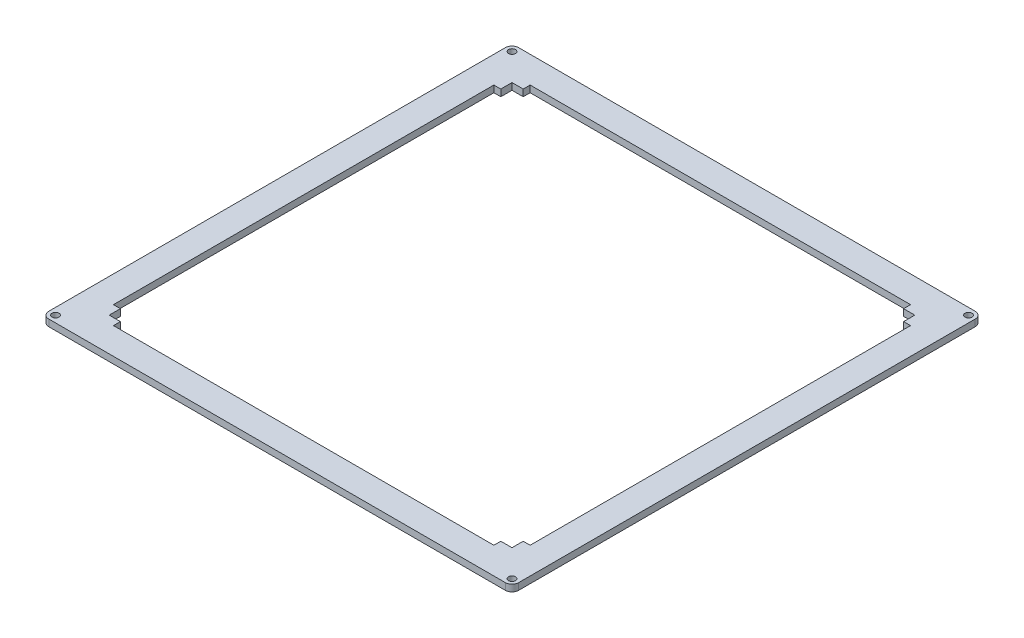
ISO-10303-21;
HEADER;
FILE_DESCRIPTION(('STEP AP214'),'2;1');
FILE_NAME('part.step','',(''),(''),'','','');
FILE_SCHEMA(('AUTOMOTIVE_DESIGN { 1 0 10303 214 1 1 1 1 }'));
ENDSEC;
DATA;
#1=APPLICATION_CONTEXT('core data for automotive mechanical design processes');
#2=APPLICATION_PROTOCOL_DEFINITION('international standard','automotive_design',2000,#1);
#3=PRODUCT_CONTEXT('',#1,'mechanical');
#4=PRODUCT('Part','Part','',(#3));
#5=PRODUCT_RELATED_PRODUCT_CATEGORY('part','',(#4));
#6=PRODUCT_DEFINITION_FORMATION('','',#4);
#7=PRODUCT_DEFINITION_CONTEXT('part definition',#1,'design');
#8=PRODUCT_DEFINITION('design','',#6,#7);
#9=PRODUCT_DEFINITION_SHAPE('','',#8);
#10=(LENGTH_UNIT() NAMED_UNIT(*) SI_UNIT(.MILLI.,.METRE.));
#11=(NAMED_UNIT(*) PLANE_ANGLE_UNIT() SI_UNIT($,.RADIAN.));
#12=(NAMED_UNIT(*) SI_UNIT($,.STERADIAN.) SOLID_ANGLE_UNIT());
#13=UNCERTAINTY_MEASURE_WITH_UNIT(LENGTH_MEASURE(1.E-05),#10,'distance_accuracy_value','');
#14=(GEOMETRIC_REPRESENTATION_CONTEXT(3) GLOBAL_UNCERTAINTY_ASSIGNED_CONTEXT((#13)) GLOBAL_UNIT_ASSIGNED_CONTEXT((#10,
#11,#12)) REPRESENTATION_CONTEXT('',''));
#15=CARTESIAN_POINT('',(0.,0.,0.));
#16=DIRECTION('',(0.,0.,1.));
#17=DIRECTION('',(1.,0.,0.));
#18=AXIS2_PLACEMENT_3D('',#15,#16,#17);
#19=CARTESIAN_POINT('',(20.0000000000018,3.,-1.79068229778268E-13));
#20=DIRECTION('',(1.,0.,0.));
#21=DIRECTION('',(0.,0.,-1.));
#22=AXIS2_PLACEMENT_3D('',#19,#20,#21);
#23=PLANE('',#22);
#24=DIRECTION('',(0.,0.,1.));
#25=VECTOR('',#24,1.);
#26=CARTESIAN_POINT('',(20.0000000000018,0.,-1.79068229778268E-13));
#27=LINE('',#26,#25);
#28=CARTESIAN_POINT('',(20.,0.,-198.1));
#29=VERTEX_POINT('',#28);
#30=CARTESIAN_POINT('',(20.0000000000001,0.,-195.));
#31=VERTEX_POINT('',#30);
#32=EDGE_CURVE('E404',#29,#31,#27,.T.);
#33=ORIENTED_EDGE('',*,*,#32,.F.);
#34=DIRECTION('',(0.,-1.,0.));
#35=VECTOR('',#34,1.);
#36=CARTESIAN_POINT('',(20.,3.,-198.1));
#37=LINE('',#36,#35);
#38=CARTESIAN_POINT('',(20.,3.,-198.1));
#39=VERTEX_POINT('',#38);
#40=EDGE_CURVE('E11',#39,#29,#37,.T.);
#41=ORIENTED_EDGE('',*,*,#40,.F.);
#42=DIRECTION('',(0.,0.,1.));
#43=VECTOR('',#42,1.);
#44=CARTESIAN_POINT('',(20.0000000000018,3.,-1.79068229778268E-13));
#45=LINE('',#44,#43);
#46=CARTESIAN_POINT('',(20.0000000000001,3.,-195.));
#47=VERTEX_POINT('',#46);
#48=EDGE_CURVE('E325',#39,#47,#45,.T.);
#49=ORIENTED_EDGE('',*,*,#48,.T.);
#50=DIRECTION('',(0.,-1.,0.));
#51=VECTOR('',#50,1.);
#52=CARTESIAN_POINT('',(20.0000000000001,3.,-195.));
#53=LINE('',#52,#51);
#54=EDGE_CURVE('E61',#47,#31,#53,.T.);
#55=ORIENTED_EDGE('',*,*,#54,.T.);
#56=EDGE_LOOP('',(#33,#41,#49,#55));
#57=FACE_BOUND('',#56,.T.);
#58=ADVANCED_FACE('F41',(#57),#23,.T.);
#59=CARTESIAN_POINT('',(0.,3.,-198.1));
#60=DIRECTION('',(0.,0.,1.));
#61=DIRECTION('',(1.,0.,0.));
#62=AXIS2_PLACEMENT_3D('',#59,#60,#61);
#63=PLANE('',#62);
#64=DIRECTION('',(-1.,0.,0.));
#65=VECTOR('',#64,1.);
#66=CARTESIAN_POINT('',(0.,0.,-198.1));
#67=LINE('',#66,#65);
#68=CARTESIAN_POINT('',(190.,0.,-198.1));
#69=VERTEX_POINT('',#68);
#70=EDGE_CURVE('E399',#69,#29,#67,.T.);
#71=ORIENTED_EDGE('',*,*,#70,.F.);
#72=DIRECTION('',(0.,-1.,0.));
#73=VECTOR('',#72,1.);
#74=CARTESIAN_POINT('',(190.,3.,-198.1));
#75=LINE('',#74,#73);
#76=CARTESIAN_POINT('',(190.,3.,-198.1));
#77=VERTEX_POINT('',#76);
#78=EDGE_CURVE('E52',#77,#69,#75,.T.);
#79=ORIENTED_EDGE('',*,*,#78,.F.);
#80=DIRECTION('',(-1.,0.,0.));
#81=VECTOR('',#80,1.);
#82=CARTESIAN_POINT('',(0.,3.,-198.1));
#83=LINE('',#82,#81);
#84=EDGE_CURVE('E319',#77,#39,#83,.T.);
#85=ORIENTED_EDGE('',*,*,#84,.T.);
#86=ORIENTED_EDGE('',*,*,#40,.T.);
#87=EDGE_LOOP('',(#71,#79,#85,#86));
#88=FACE_BOUND('',#87,.T.);
#89=ADVANCED_FACE('F575',(#88),#63,.T.);
#90=CARTESIAN_POINT('',(190.,3.,0.));
#91=DIRECTION('',(1.,0.,0.));
#92=DIRECTION('',(0.,0.,-1.));
#93=AXIS2_PLACEMENT_3D('',#90,#91,#92);
#94=PLANE('',#93);
#95=DIRECTION('',(0.,0.,1.));
#96=VECTOR('',#95,1.);
#97=CARTESIAN_POINT('',(190.,0.,0.));
#98=LINE('',#97,#96);
#99=CARTESIAN_POINT('',(190.,0.,-195.));
#100=VERTEX_POINT('',#99);
#101=EDGE_CURVE('E389',#69,#100,#98,.T.);
#102=ORIENTED_EDGE('',*,*,#101,.T.);
#103=DIRECTION('',(0.,-1.,0.));
#104=VECTOR('',#103,1.);
#105=CARTESIAN_POINT('',(190.,3.,-195.));
#106=LINE('',#105,#104);
#107=CARTESIAN_POINT('',(190.,3.,-195.));
#108=VERTEX_POINT('',#107);
#109=EDGE_CURVE('E557',#108,#100,#106,.T.);
#110=ORIENTED_EDGE('',*,*,#109,.F.);
#111=DIRECTION('',(0.,0.,1.));
#112=VECTOR('',#111,1.);
#113=CARTESIAN_POINT('',(190.,3.,0.));
#114=LINE('',#113,#112);
#115=EDGE_CURVE('E316',#77,#108,#114,.T.);
#116=ORIENTED_EDGE('',*,*,#115,.F.);
#117=ORIENTED_EDGE('',*,*,#78,.T.);
#118=EDGE_LOOP('',(#102,#110,#116,#117));
#119=FACE_BOUND('',#118,.T.);
#120=ADVANCED_FACE('F580',(#119),#94,.F.);
#121=CARTESIAN_POINT('',(0.,3.,-195.));
#122=DIRECTION('',(0.,0.,1.));
#123=DIRECTION('',(1.,0.,0.));
#124=AXIS2_PLACEMENT_3D('',#121,#122,#123);
#125=PLANE('',#124);
#126=DIRECTION('',(-1.,0.,0.));
#127=VECTOR('',#126,1.);
#128=CARTESIAN_POINT('',(0.,0.,-195.));
#129=LINE('',#128,#127);
#130=CARTESIAN_POINT('',(195.,0.,-195.));
#131=VERTEX_POINT('',#130);
#132=EDGE_CURVE('E379',#131,#100,#129,.T.);
#133=ORIENTED_EDGE('',*,*,#132,.F.);
#134=DIRECTION('',(0.,-1.,0.));
#135=VECTOR('',#134,1.);
#136=CARTESIAN_POINT('',(195.,3.,-195.));
#137=LINE('',#136,#135);
#138=CARTESIAN_POINT('',(195.,3.,-195.));
#139=VERTEX_POINT('',#138);
#140=EDGE_CURVE('E554',#139,#131,#137,.T.);
#141=ORIENTED_EDGE('',*,*,#140,.F.);
#142=DIRECTION('',(-1.,0.,0.));
#143=VECTOR('',#142,1.);
#144=CARTESIAN_POINT('',(0.,3.,-195.));
#145=LINE('',#144,#143);
#146=EDGE_CURVE('E265',#139,#108,#145,.T.);
#147=ORIENTED_EDGE('',*,*,#146,.T.);
#148=ORIENTED_EDGE('',*,*,#109,.T.);
#149=EDGE_LOOP('',(#133,#141,#147,#148));
#150=FACE_BOUND('',#149,.T.);
#151=ADVANCED_FACE('F660',(#150),#125,.T.);
#152=CARTESIAN_POINT('',(195.,3.,0.));
#153=DIRECTION('',(1.,0.,0.));
#154=DIRECTION('',(0.,0.,-1.));
#155=AXIS2_PLACEMENT_3D('',#152,#153,#154);
#156=PLANE('',#155);
#157=DIRECTION('',(0.,0.,1.));
#158=VECTOR('',#157,1.);
#159=CARTESIAN_POINT('',(195.,0.,0.));
#160=LINE('',#159,#158);
#161=CARTESIAN_POINT('',(195.,0.,-190.));
#162=VERTEX_POINT('',#161);
#163=EDGE_CURVE('E388',#131,#162,#160,.T.);
#164=ORIENTED_EDGE('',*,*,#163,.T.);
#165=DIRECTION('',(0.,-1.,0.));
#166=VECTOR('',#165,1.);
#167=CARTESIAN_POINT('',(195.,3.,-190.));
#168=LINE('',#167,#166);
#169=CARTESIAN_POINT('',(195.,3.,-190.));
#170=VERTEX_POINT('',#169);
#171=EDGE_CURVE('E550',#170,#162,#168,.T.);
#172=ORIENTED_EDGE('',*,*,#171,.F.);
#173=DIRECTION('',(0.,0.,1.));
#174=VECTOR('',#173,1.);
#175=CARTESIAN_POINT('',(195.,3.,0.));
#176=LINE('',#175,#174);
#177=EDGE_CURVE('E298',#139,#170,#176,.T.);
#178=ORIENTED_EDGE('',*,*,#177,.F.);
#179=ORIENTED_EDGE('',*,*,#140,.T.);
#180=EDGE_LOOP('',(#164,#172,#178,#179));
#181=FACE_BOUND('',#180,.T.);
#182=ADVANCED_FACE('F843',(#181),#156,.F.);
#183=CARTESIAN_POINT('',(0.,3.,-190.));
#184=DIRECTION('',(0.,0.,-1.));
#185=DIRECTION('',(-1.,0.,0.));
#186=AXIS2_PLACEMENT_3D('',#183,#184,#185);
#187=PLANE('',#186);
#188=DIRECTION('',(1.,0.,0.));
#189=VECTOR('',#188,1.);
#190=CARTESIAN_POINT('',(0.,0.,-190.));
#191=LINE('',#190,#189);
#192=CARTESIAN_POINT('',(198.1,0.,-190.));
#193=VERTEX_POINT('',#192);
#194=EDGE_CURVE('E396',#162,#193,#191,.T.);
#195=ORIENTED_EDGE('',*,*,#194,.T.);
#196=DIRECTION('',(0.,-1.,0.));
#197=VECTOR('',#196,1.);
#198=CARTESIAN_POINT('',(198.1,3.,-190.));
#199=LINE('',#198,#197);
#200=CARTESIAN_POINT('',(198.1,3.,-190.));
#201=VERTEX_POINT('',#200);
#202=EDGE_CURVE('E546',#201,#193,#199,.T.);
#203=ORIENTED_EDGE('',*,*,#202,.F.);
#204=DIRECTION('',(1.,0.,0.));
#205=VECTOR('',#204,1.);
#206=CARTESIAN_POINT('',(0.,3.,-190.));
#207=LINE('',#206,#205);
#208=EDGE_CURVE('E308',#170,#201,#207,.T.);
#209=ORIENTED_EDGE('',*,*,#208,.F.);
#210=ORIENTED_EDGE('',*,*,#171,.T.);
#211=EDGE_LOOP('',(#195,#203,#209,#210));
#212=FACE_BOUND('',#211,.T.);
#213=ADVANCED_FACE('F864',(#212),#187,.F.);
#214=CARTESIAN_POINT('',(198.1,3.,0.));
#215=DIRECTION('',(1.,0.,0.));
#216=DIRECTION('',(0.,0.,-1.));
#217=AXIS2_PLACEMENT_3D('',#214,#215,#216);
#218=PLANE('',#217);
#219=DIRECTION('',(0.,0.,1.));
#220=VECTOR('',#219,1.);
#221=CARTESIAN_POINT('',(198.1,0.,0.));
#222=LINE('',#221,#220);
#223=CARTESIAN_POINT('',(198.1,0.,-20.0000000000001));
#224=VERTEX_POINT('',#223);
#225=EDGE_CURVE('E939',#193,#224,#222,.T.);
#226=ORIENTED_EDGE('',*,*,#225,.T.);
#227=DIRECTION('',(0.,-1.,0.));
#228=VECTOR('',#227,1.);
#229=CARTESIAN_POINT('',(198.1,3.,-20.0000000000001));
#230=LINE('',#229,#228);
#231=CARTESIAN_POINT('',(198.1,3.,-20.0000000000001));
#232=VERTEX_POINT('',#231);
#233=EDGE_CURVE('E543',#232,#224,#230,.T.);
#234=ORIENTED_EDGE('',*,*,#233,.F.);
#235=DIRECTION('',(0.,0.,1.));
#236=VECTOR('',#235,1.);
#237=CARTESIAN_POINT('',(198.1,3.,0.));
#238=LINE('',#237,#236);
#239=EDGE_CURVE('E304',#201,#232,#238,.T.);
#240=ORIENTED_EDGE('',*,*,#239,.F.);
#241=ORIENTED_EDGE('',*,*,#202,.T.);
#242=EDGE_LOOP('',(#226,#234,#240,#241));
#243=FACE_BOUND('',#242,.T.);
#244=ADVANCED_FACE('F853',(#243),#218,.F.);
#245=CARTESIAN_POINT('',(0.,3.,-20.0000000000001));
#246=DIRECTION('',(0.,0.,-1.));
#247=DIRECTION('',(-1.,0.,0.));
#248=AXIS2_PLACEMENT_3D('',#245,#246,#247);
#249=PLANE('',#248);
#250=DIRECTION('',(1.,0.,0.));
#251=VECTOR('',#250,1.);
#252=CARTESIAN_POINT('',(0.,0.,-20.0000000000001));
#253=LINE('',#252,#251);
#254=CARTESIAN_POINT('',(195.,0.,-20.0000000000001));
#255=VERTEX_POINT('',#254);
#256=EDGE_CURVE('E942',#255,#224,#253,.T.);
#257=ORIENTED_EDGE('',*,*,#256,.F.);
#258=DIRECTION('',(0.,-1.,0.));
#259=VECTOR('',#258,1.);
#260=CARTESIAN_POINT('',(195.,3.,-20.0000000000001));
#261=LINE('',#260,#259);
#262=CARTESIAN_POINT('',(195.,3.,-20.0000000000001));
#263=VERTEX_POINT('',#262);
#264=EDGE_CURVE('E540',#263,#255,#261,.T.);
#265=ORIENTED_EDGE('',*,*,#264,.F.);
#266=DIRECTION('',(1.,0.,0.));
#267=VECTOR('',#266,1.);
#268=CARTESIAN_POINT('',(0.,3.,-20.0000000000001));
#269=LINE('',#268,#267);
#270=EDGE_CURVE('E296',#263,#232,#269,.T.);
#271=ORIENTED_EDGE('',*,*,#270,.T.);
#272=ORIENTED_EDGE('',*,*,#233,.T.);
#273=EDGE_LOOP('',(#257,#265,#271,#272));
#274=FACE_BOUND('',#273,.T.);
#275=ADVANCED_FACE('F840',(#274),#249,.T.);
#276=CARTESIAN_POINT('',(195.,0.,-15.));
#277=VERTEX_POINT('',#276);
#278=EDGE_CURVE('E397',#255,#277,#160,.T.);
#279=ORIENTED_EDGE('',*,*,#278,.T.);
#280=DIRECTION('',(0.,-1.,0.));
#281=VECTOR('',#280,1.);
#282=CARTESIAN_POINT('',(195.,3.,-15.));
#283=LINE('',#282,#281);
#284=CARTESIAN_POINT('',(195.,3.,-15.));
#285=VERTEX_POINT('',#284);
#286=EDGE_CURVE('E536',#285,#277,#283,.T.);
#287=ORIENTED_EDGE('',*,*,#286,.F.);
#288=EDGE_CURVE('E290',#263,#285,#176,.T.);
#289=ORIENTED_EDGE('',*,*,#288,.F.);
#290=ORIENTED_EDGE('',*,*,#264,.T.);
#291=EDGE_LOOP('',(#279,#287,#289,#290));
#292=FACE_BOUND('',#291,.T.);
#293=ADVANCED_FACE('F830',(#292),#156,.F.);
#294=CARTESIAN_POINT('',(0.,3.,-15.));
#295=DIRECTION('',(0.,0.,1.));
#296=DIRECTION('',(1.,0.,0.));
#297=AXIS2_PLACEMENT_3D('',#294,#295,#296);
#298=PLANE('',#297);
#299=DIRECTION('',(-1.,0.,0.));
#300=VECTOR('',#299,1.);
#301=CARTESIAN_POINT('',(0.,0.,-15.));
#302=LINE('',#301,#300);
#303=CARTESIAN_POINT('',(190.,0.,-15.));
#304=VERTEX_POINT('',#303);
#305=EDGE_CURVE('E946',#277,#304,#302,.T.);
#306=ORIENTED_EDGE('',*,*,#305,.T.);
#307=DIRECTION('',(0.,-1.,0.));
#308=VECTOR('',#307,1.);
#309=CARTESIAN_POINT('',(190.,3.,-15.));
#310=LINE('',#309,#308);
#311=CARTESIAN_POINT('',(190.,3.,-15.));
#312=VERTEX_POINT('',#311);
#313=EDGE_CURVE('E532',#312,#304,#310,.T.);
#314=ORIENTED_EDGE('',*,*,#313,.F.);
#315=DIRECTION('',(-1.,0.,0.));
#316=VECTOR('',#315,1.);
#317=CARTESIAN_POINT('',(0.,3.,-15.));
#318=LINE('',#317,#316);
#319=EDGE_CURVE('E278',#285,#312,#318,.T.);
#320=ORIENTED_EDGE('',*,*,#319,.F.);
#321=ORIENTED_EDGE('',*,*,#286,.T.);
#322=EDGE_LOOP('',(#306,#314,#320,#321));
#323=FACE_BOUND('',#322,.T.);
#324=ADVANCED_FACE('F788',(#323),#298,.F.);
#325=CARTESIAN_POINT('',(190.,3.,0.));
#326=DIRECTION('',(1.,0.,0.));
#327=DIRECTION('',(0.,0.,-1.));
#328=AXIS2_PLACEMENT_3D('',#325,#326,#327);
#329=PLANE('',#328);
#330=DIRECTION('',(0.,0.,1.));
#331=VECTOR('',#330,1.);
#332=CARTESIAN_POINT('',(190.,0.,0.));
#333=LINE('',#332,#331);
#334=CARTESIAN_POINT('',(190.,0.,-11.9));
#335=VERTEX_POINT('',#334);
#336=EDGE_CURVE('E949',#304,#335,#333,.T.);
#337=ORIENTED_EDGE('',*,*,#336,.T.);
#338=DIRECTION('',(0.,-1.,0.));
#339=VECTOR('',#338,1.);
#340=CARTESIAN_POINT('',(190.,3.,-11.9));
#341=LINE('',#340,#339);
#342=CARTESIAN_POINT('',(190.,3.,-11.9));
#343=VERTEX_POINT('',#342);
#344=EDGE_CURVE('E528',#343,#335,#341,.T.);
#345=ORIENTED_EDGE('',*,*,#344,.F.);
#346=DIRECTION('',(0.,0.,1.));
#347=VECTOR('',#346,1.);
#348=CARTESIAN_POINT('',(190.,3.,0.));
#349=LINE('',#348,#347);
#350=EDGE_CURVE('E289',#312,#343,#349,.T.);
#351=ORIENTED_EDGE('',*,*,#350,.F.);
#352=ORIENTED_EDGE('',*,*,#313,.T.);
#353=EDGE_LOOP('',(#337,#345,#351,#352));
#354=FACE_BOUND('',#353,.T.);
#355=ADVANCED_FACE('F809',(#354),#329,.F.);
#356=CARTESIAN_POINT('',(0.,3.,-11.9));
#357=DIRECTION('',(0.,0.,1.));
#358=DIRECTION('',(1.,0.,0.));
#359=AXIS2_PLACEMENT_3D('',#356,#357,#358);
#360=PLANE('',#359);
#361=DIRECTION('',(-1.,0.,0.));
#362=VECTOR('',#361,1.);
#363=CARTESIAN_POINT('',(0.,0.,-11.9));
#364=LINE('',#363,#362);
#365=CARTESIAN_POINT('',(20.,0.,-11.9));
#366=VERTEX_POINT('',#365);
#367=EDGE_CURVE('E954',#335,#366,#364,.T.);
#368=ORIENTED_EDGE('',*,*,#367,.T.);
#369=DIRECTION('',(0.,-1.,0.));
#370=VECTOR('',#369,1.);
#371=CARTESIAN_POINT('',(20.,3.,-11.9));
#372=LINE('',#371,#370);
#373=CARTESIAN_POINT('',(20.,3.,-11.9));
#374=VERTEX_POINT('',#373);
#375=EDGE_CURVE('E525',#374,#366,#372,.T.);
#376=ORIENTED_EDGE('',*,*,#375,.F.);
#377=DIRECTION('',(-1.,0.,0.));
#378=VECTOR('',#377,1.);
#379=CARTESIAN_POINT('',(0.,3.,-11.9));
#380=LINE('',#379,#378);
#381=EDGE_CURVE('E284',#343,#374,#380,.T.);
#382=ORIENTED_EDGE('',*,*,#381,.F.);
#383=ORIENTED_EDGE('',*,*,#344,.T.);
#384=EDGE_LOOP('',(#368,#376,#382,#383));
#385=FACE_BOUND('',#384,.T.);
#386=ADVANCED_FACE('F798',(#385),#360,.F.);
#387=CARTESIAN_POINT('',(20.,3.,0.));
#388=DIRECTION('',(1.,0.,0.));
#389=DIRECTION('',(0.,0.,-1.));
#390=AXIS2_PLACEMENT_3D('',#387,#388,#389);
#391=PLANE('',#390);
#392=DIRECTION('',(0.,0.,1.));
#393=VECTOR('',#392,1.);
#394=CARTESIAN_POINT('',(20.,0.,0.));
#395=LINE('',#394,#393);
#396=CARTESIAN_POINT('',(20.,0.,-15.));
#397=VERTEX_POINT('',#396);
#398=EDGE_CURVE('E957',#397,#366,#395,.T.);
#399=ORIENTED_EDGE('',*,*,#398,.F.);
#400=DIRECTION('',(0.,-1.,0.));
#401=VECTOR('',#400,1.);
#402=CARTESIAN_POINT('',(20.,3.,-15.));
#403=LINE('',#402,#401);
#404=CARTESIAN_POINT('',(20.,3.,-15.));
#405=VERTEX_POINT('',#404);
#406=EDGE_CURVE('E522',#405,#397,#403,.T.);
#407=ORIENTED_EDGE('',*,*,#406,.F.);
#408=DIRECTION('',(0.,0.,1.));
#409=VECTOR('',#408,1.);
#410=CARTESIAN_POINT('',(20.,3.,0.));
#411=LINE('',#410,#409);
#412=EDGE_CURVE('E276',#405,#374,#411,.T.);
#413=ORIENTED_EDGE('',*,*,#412,.T.);
#414=ORIENTED_EDGE('',*,*,#375,.T.);
#415=EDGE_LOOP('',(#399,#407,#413,#414));
#416=FACE_BOUND('',#415,.T.);
#417=ADVANCED_FACE('F785',(#416),#391,.T.);
#418=CARTESIAN_POINT('',(15.,0.,-15.));
#419=VERTEX_POINT('',#418);
#420=EDGE_CURVE('E960',#397,#419,#302,.T.);
#421=ORIENTED_EDGE('',*,*,#420,.T.);
#422=DIRECTION('',(0.,-1.,0.));
#423=VECTOR('',#422,1.);
#424=CARTESIAN_POINT('',(15.,3.,-15.));
#425=LINE('',#424,#423);
#426=CARTESIAN_POINT('',(15.,3.,-15.));
#427=VERTEX_POINT('',#426);
#428=EDGE_CURVE('E519',#427,#419,#425,.T.);
#429=ORIENTED_EDGE('',*,*,#428,.F.);
#430=EDGE_CURVE('E271',#405,#427,#318,.T.);
#431=ORIENTED_EDGE('',*,*,#430,.F.);
#432=ORIENTED_EDGE('',*,*,#406,.T.);
#433=EDGE_LOOP('',(#421,#429,#431,#432));
#434=FACE_BOUND('',#433,.T.);
#435=ADVANCED_FACE('F776',(#434),#298,.F.);
#436=CARTESIAN_POINT('',(15.,3.,0.));
#437=DIRECTION('',(1.,0.,0.));
#438=DIRECTION('',(0.,0.,-1.));
#439=AXIS2_PLACEMENT_3D('',#436,#437,#438);
#440=PLANE('',#439);
#441=DIRECTION('',(0.,0.,1.));
#442=VECTOR('',#441,1.);
#443=CARTESIAN_POINT('',(15.,0.,0.));
#444=LINE('',#443,#442);
#445=CARTESIAN_POINT('',(15.,0.,-20.));
#446=VERTEX_POINT('',#445);
#447=EDGE_CURVE('E383',#446,#419,#444,.T.);
#448=ORIENTED_EDGE('',*,*,#447,.F.);
#449=DIRECTION('',(0.,-1.,0.));
#450=VECTOR('',#449,1.);
#451=CARTESIAN_POINT('',(15.,3.,-20.));
#452=LINE('',#451,#450);
#453=CARTESIAN_POINT('',(15.,3.,-20.));
#454=VERTEX_POINT('',#453);
#455=EDGE_CURVE('E516',#454,#446,#452,.T.);
#456=ORIENTED_EDGE('',*,*,#455,.F.);
#457=DIRECTION('',(0.,0.,1.));
#458=VECTOR('',#457,1.);
#459=CARTESIAN_POINT('',(15.,3.,0.));
#460=LINE('',#459,#458);
#461=EDGE_CURVE('E261',#454,#427,#460,.T.);
#462=ORIENTED_EDGE('',*,*,#461,.T.);
#463=ORIENTED_EDGE('',*,*,#428,.T.);
#464=EDGE_LOOP('',(#448,#456,#462,#463));
#465=FACE_BOUND('',#464,.T.);
#466=ADVANCED_FACE('F573',(#465),#440,.T.);
#467=CARTESIAN_POINT('',(0.,3.,-20.));
#468=DIRECTION('',(0.,0.,1.));
#469=DIRECTION('',(1.,0.,0.));
#470=AXIS2_PLACEMENT_3D('',#467,#468,#469);
#471=PLANE('',#470);
#472=DIRECTION('',(-1.,0.,0.));
#473=VECTOR('',#472,1.);
#474=CARTESIAN_POINT('',(0.,0.,-20.));
#475=LINE('',#474,#473);
#476=CARTESIAN_POINT('',(11.9,0.,-20.));
#477=VERTEX_POINT('',#476);
#478=EDGE_CURVE('E966',#446,#477,#475,.T.);
#479=ORIENTED_EDGE('',*,*,#478,.T.);
#480=DIRECTION('',(0.,-1.,0.));
#481=VECTOR('',#480,1.);
#482=CARTESIAN_POINT('',(11.9,3.,-20.));
#483=LINE('',#482,#481);
#484=CARTESIAN_POINT('',(11.9,3.,-20.));
#485=VERTEX_POINT('',#484);
#486=EDGE_CURVE('E512',#485,#477,#483,.T.);
#487=ORIENTED_EDGE('',*,*,#486,.F.);
#488=DIRECTION('',(-1.,0.,0.));
#489=VECTOR('',#488,1.);
#490=CARTESIAN_POINT('',(0.,3.,-20.));
#491=LINE('',#490,#489);
#492=EDGE_CURVE('E270',#454,#485,#491,.T.);
#493=ORIENTED_EDGE('',*,*,#492,.F.);
#494=ORIENTED_EDGE('',*,*,#455,.T.);
#495=EDGE_LOOP('',(#479,#487,#493,#494));
#496=FACE_BOUND('',#495,.T.);
#497=ADVANCED_FACE('F755',(#496),#471,.F.);
#498=CARTESIAN_POINT('',(11.9,3.,0.));
#499=DIRECTION('',(-1.,0.,0.));
#500=DIRECTION('',(0.,0.,1.));
#501=AXIS2_PLACEMENT_3D('',#498,#499,#500);
#502=PLANE('',#501);
#503=DIRECTION('',(0.,0.,-1.));
#504=VECTOR('',#503,1.);
#505=CARTESIAN_POINT('',(11.9,0.,0.));
#506=LINE('',#505,#504);
#507=CARTESIAN_POINT('',(11.9,0.,-190.));
#508=VERTEX_POINT('',#507);
#509=EDGE_CURVE('E970',#477,#508,#506,.T.);
#510=ORIENTED_EDGE('',*,*,#509,.T.);
#511=DIRECTION('',(0.,-1.,0.));
#512=VECTOR('',#511,1.);
#513=CARTESIAN_POINT('',(11.9,3.,-190.));
#514=LINE('',#513,#512);
#515=CARTESIAN_POINT('',(11.9,3.,-190.));
#516=VERTEX_POINT('',#515);
#517=EDGE_CURVE('E244',#516,#508,#514,.T.);
#518=ORIENTED_EDGE('',*,*,#517,.F.);
#519=DIRECTION('',(0.,0.,-1.));
#520=VECTOR('',#519,1.);
#521=CARTESIAN_POINT('',(11.9,3.,0.));
#522=LINE('',#521,#520);
#523=EDGE_CURVE('E253',#485,#516,#522,.T.);
#524=ORIENTED_EDGE('',*,*,#523,.F.);
#525=ORIENTED_EDGE('',*,*,#486,.T.);
#526=EDGE_LOOP('',(#510,#518,#524,#525));
#527=FACE_BOUND('',#526,.T.);
#528=ADVANCED_FACE('F745',(#527),#502,.F.);
#529=CARTESIAN_POINT('',(0.,3.,-190.));
#530=DIRECTION('',(0.,0.,1.));
#531=DIRECTION('',(1.,0.,0.));
#532=AXIS2_PLACEMENT_3D('',#529,#530,#531);
#533=PLANE('',#532);
#534=DIRECTION('',(-1.,0.,0.));
#535=VECTOR('',#534,1.);
#536=CARTESIAN_POINT('',(0.,0.,-190.));
#537=LINE('',#536,#535);
#538=CARTESIAN_POINT('',(15.,0.,-190.));
#539=VERTEX_POINT('',#538);
#540=EDGE_CURVE('E239',#539,#508,#537,.T.);
#541=ORIENTED_EDGE('',*,*,#540,.F.);
#542=DIRECTION('',(0.,-1.,0.));
#543=VECTOR('',#542,1.);
#544=CARTESIAN_POINT('',(15.,3.,-190.));
#545=LINE('',#544,#543);
#546=CARTESIAN_POINT('',(15.,3.,-190.));
#547=VERTEX_POINT('',#546);
#548=EDGE_CURVE('E234',#547,#539,#545,.T.);
#549=ORIENTED_EDGE('',*,*,#548,.F.);
#550=DIRECTION('',(-1.,0.,0.));
#551=VECTOR('',#550,1.);
#552=CARTESIAN_POINT('',(0.,3.,-190.));
#553=LINE('',#552,#551);
#554=EDGE_CURVE('E237',#547,#516,#553,.T.);
#555=ORIENTED_EDGE('',*,*,#554,.T.);
#556=ORIENTED_EDGE('',*,*,#517,.T.);
#557=EDGE_LOOP('',(#541,#549,#555,#556));
#558=FACE_BOUND('',#557,.T.);
#559=ADVANCED_FACE('F236',(#558),#533,.T.);
#560=CARTESIAN_POINT('',(15.,0.,-195.));
#561=VERTEX_POINT('',#560);
#562=EDGE_CURVE('E377',#561,#539,#444,.T.);
#563=ORIENTED_EDGE('',*,*,#562,.F.);
#564=DIRECTION('',(0.,-1.,0.));
#565=VECTOR('',#564,1.);
#566=CARTESIAN_POINT('',(15.,3.,-195.));
#567=LINE('',#566,#565);
#568=CARTESIAN_POINT('',(15.,3.,-195.));
#569=VERTEX_POINT('',#568);
#570=EDGE_CURVE('E146',#569,#561,#567,.T.);
#571=ORIENTED_EDGE('',*,*,#570,.F.);
#572=EDGE_CURVE('E251',#569,#547,#460,.T.);
#573=ORIENTED_EDGE('',*,*,#572,.T.);
#574=ORIENTED_EDGE('',*,*,#548,.T.);
#575=EDGE_LOOP('',(#563,#571,#573,#574));
#576=FACE_BOUND('',#575,.T.);
#577=ADVANCED_FACE('F257',(#576),#440,.T.);
#578=CARTESIAN_POINT('',(3.,3.,-3.));
#579=DIRECTION('',(0.,-1.,0.));
#580=DIRECTION('',(0.,0.,-1.));
#581=AXIS2_PLACEMENT_3D('',#578,#579,#580);
#582=CYLINDRICAL_SURFACE('',#581,3.);
#583=CARTESIAN_POINT('',(3.,0.,-3.));
#584=DIRECTION('',(0.,1.,0.));
#585=DIRECTION('',(0.,0.,1.));
#586=AXIS2_PLACEMENT_3D('',#583,#584,#585);
#587=CIRCLE('',#586,3.);
#588=CARTESIAN_POINT('',(3.,0.,0.));
#589=VERTEX_POINT('',#588);
#590=CARTESIAN_POINT('',(0.,0.,-3.));
#591=VERTEX_POINT('',#590);
#592=EDGE_CURVE('E453',#589,#591,#587,.F.);
#593=ORIENTED_EDGE('',*,*,#592,.F.);
#594=DIRECTION('',(0.,-1.,0.));
#595=VECTOR('',#594,1.);
#596=CARTESIAN_POINT('',(3.,3.,0.));
#597=LINE('',#596,#595);
#598=CARTESIAN_POINT('',(3.,3.,0.));
#599=VERTEX_POINT('',#598);
#600=EDGE_CURVE('E45',#599,#589,#597,.T.);
#601=ORIENTED_EDGE('',*,*,#600,.F.);
#602=CARTESIAN_POINT('',(3.,3.,-3.));
#603=DIRECTION('',(0.,1.,0.));
#604=DIRECTION('',(0.,0.,1.));
#605=AXIS2_PLACEMENT_3D('',#602,#603,#604);
#606=CIRCLE('',#605,3.);
#607=CARTESIAN_POINT('',(0.,3.,-3.));
#608=VERTEX_POINT('',#607);
#609=EDGE_CURVE('E370',#599,#608,#606,.F.);
#610=ORIENTED_EDGE('',*,*,#609,.T.);
#611=DIRECTION('',(0.,-1.,0.));
#612=VECTOR('',#611,1.);
#613=CARTESIAN_POINT('',(0.,3.,-3.));
#614=LINE('',#613,#612);
#615=EDGE_CURVE('E263',#608,#591,#614,.T.);
#616=ORIENTED_EDGE('',*,*,#615,.T.);
#617=EDGE_LOOP('',(#593,#601,#610,#616));
#618=FACE_BOUND('',#617,.T.);
#619=ADVANCED_FACE('F43',(#618),#582,.T.);
#620=CARTESIAN_POINT('',(0.,3.,0.));
#621=DIRECTION('',(0.,0.,-1.));
#622=DIRECTION('',(-1.,0.,0.));
#623=AXIS2_PLACEMENT_3D('',#620,#621,#622);
#624=PLANE('',#623);
#625=DIRECTION('',(1.,0.,0.));
#626=VECTOR('',#625,1.);
#627=CARTESIAN_POINT('',(0.,0.,0.));
#628=LINE('',#627,#626);
#629=CARTESIAN_POINT('',(207.,0.,0.));
#630=VERTEX_POINT('',#629);
#631=EDGE_CURVE('E449',#589,#630,#628,.T.);
#632=ORIENTED_EDGE('',*,*,#631,.T.);
#633=DIRECTION('',(0.,-1.,0.));
#634=VECTOR('',#633,1.);
#635=CARTESIAN_POINT('',(207.,3.,0.));
#636=LINE('',#635,#634);
#637=CARTESIAN_POINT('',(207.,3.,0.));
#638=VERTEX_POINT('',#637);
#639=EDGE_CURVE('E497',#638,#630,#636,.T.);
#640=ORIENTED_EDGE('',*,*,#639,.F.);
#641=DIRECTION('',(1.,0.,0.));
#642=VECTOR('',#641,1.);
#643=CARTESIAN_POINT('',(0.,3.,0.));
#644=LINE('',#643,#642);
#645=EDGE_CURVE('E367',#599,#638,#644,.T.);
#646=ORIENTED_EDGE('',*,*,#645,.F.);
#647=ORIENTED_EDGE('',*,*,#600,.T.);
#648=EDGE_LOOP('',(#632,#640,#646,#647));
#649=FACE_BOUND('',#648,.T.);
#650=ADVANCED_FACE('F501',(#649),#624,.F.);
#651=CARTESIAN_POINT('',(207.,3.,-3.));
#652=DIRECTION('',(0.,-1.,0.));
#653=DIRECTION('',(0.,0.,-1.));
#654=AXIS2_PLACEMENT_3D('',#651,#652,#653);
#655=CYLINDRICAL_SURFACE('',#654,3.);
#656=CARTESIAN_POINT('',(207.,0.,-3.));
#657=DIRECTION('',(0.,1.,0.));
#658=DIRECTION('',(0.,0.,1.));
#659=AXIS2_PLACEMENT_3D('',#656,#657,#658);
#660=CIRCLE('',#659,3.);
#661=CARTESIAN_POINT('',(210.,0.,-3.));
#662=VERTEX_POINT('',#661);
#663=EDGE_CURVE('E445',#662,#630,#660,.F.);
#664=ORIENTED_EDGE('',*,*,#663,.F.);
#665=DIRECTION('',(0.,-1.,0.));
#666=VECTOR('',#665,1.);
#667=CARTESIAN_POINT('',(210.,3.,-3.));
#668=LINE('',#667,#666);
#669=CARTESIAN_POINT('',(210.,3.,-3.));
#670=VERTEX_POINT('',#669);
#671=EDGE_CURVE('E490',#670,#662,#668,.T.);
#672=ORIENTED_EDGE('',*,*,#671,.F.);
#673=CARTESIAN_POINT('',(207.,3.,-3.));
#674=DIRECTION('',(0.,1.,0.));
#675=DIRECTION('',(0.,0.,1.));
#676=AXIS2_PLACEMENT_3D('',#673,#674,#675);
#677=CIRCLE('',#676,3.);
#678=EDGE_CURVE('E363',#670,#638,#677,.F.);
#679=ORIENTED_EDGE('',*,*,#678,.T.);
#680=ORIENTED_EDGE('',*,*,#639,.T.);
#681=EDGE_LOOP('',(#664,#672,#679,#680));
#682=FACE_BOUND('',#681,.T.);
#683=ADVANCED_FACE('F495',(#682),#655,.T.);
#684=CARTESIAN_POINT('',(210.,3.,0.));
#685=DIRECTION('',(-1.,0.,0.));
#686=DIRECTION('',(0.,0.,1.));
#687=AXIS2_PLACEMENT_3D('',#684,#685,#686);
#688=PLANE('',#687);
#689=DIRECTION('',(0.,0.,-1.));
#690=VECTOR('',#689,1.);
#691=CARTESIAN_POINT('',(210.,0.,0.));
#692=LINE('',#691,#690);
#693=CARTESIAN_POINT('',(210.,0.,-207.));
#694=VERTEX_POINT('',#693);
#695=EDGE_CURVE('E441',#662,#694,#692,.T.);
#696=ORIENTED_EDGE('',*,*,#695,.T.);
#697=DIRECTION('',(0.,-1.,0.));
#698=VECTOR('',#697,1.);
#699=CARTESIAN_POINT('',(210.,3.,-207.));
#700=LINE('',#699,#698);
#701=CARTESIAN_POINT('',(210.,3.,-207.));
#702=VERTEX_POINT('',#701);
#703=EDGE_CURVE('E483',#702,#694,#700,.T.);
#704=ORIENTED_EDGE('',*,*,#703,.F.);
#705=DIRECTION('',(0.,0.,-1.));
#706=VECTOR('',#705,1.);
#707=CARTESIAN_POINT('',(210.,3.,0.));
#708=LINE('',#707,#706);
#709=EDGE_CURVE('E360',#670,#702,#708,.T.);
#710=ORIENTED_EDGE('',*,*,#709,.F.);
#711=ORIENTED_EDGE('',*,*,#671,.T.);
#712=EDGE_LOOP('',(#696,#704,#710,#711));
#713=FACE_BOUND('',#712,.T.);
#714=ADVANCED_FACE('F492',(#713),#688,.F.);
#715=CARTESIAN_POINT('',(207.,3.,-207.));
#716=DIRECTION('',(0.,-1.,0.));
#717=DIRECTION('',(0.,0.,-1.));
#718=AXIS2_PLACEMENT_3D('',#715,#716,#717);
#719=CYLINDRICAL_SURFACE('',#718,3.);
#720=CARTESIAN_POINT('',(207.,0.,-207.));
#721=DIRECTION('',(0.,1.,0.));
#722=DIRECTION('',(0.,0.,1.));
#723=AXIS2_PLACEMENT_3D('',#720,#721,#722);
#724=CIRCLE('',#723,3.);
#725=CARTESIAN_POINT('',(207.,0.,-210.));
#726=VERTEX_POINT('',#725);
#727=EDGE_CURVE('E437',#726,#694,#724,.F.);
#728=ORIENTED_EDGE('',*,*,#727,.F.);
#729=DIRECTION('',(0.,-1.,0.));
#730=VECTOR('',#729,1.);
#731=CARTESIAN_POINT('',(207.,3.,-210.));
#732=LINE('',#731,#730);
#733=CARTESIAN_POINT('',(207.,3.,-210.));
#734=VERTEX_POINT('',#733);
#735=EDGE_CURVE('E479',#734,#726,#732,.T.);
#736=ORIENTED_EDGE('',*,*,#735,.F.);
#737=CARTESIAN_POINT('',(207.,3.,-207.));
#738=DIRECTION('',(0.,1.,0.));
#739=DIRECTION('',(0.,0.,1.));
#740=AXIS2_PLACEMENT_3D('',#737,#738,#739);
#741=CIRCLE('',#740,3.);
#742=EDGE_CURVE('E356',#734,#702,#741,.F.);
#743=ORIENTED_EDGE('',*,*,#742,.T.);
#744=ORIENTED_EDGE('',*,*,#703,.T.);
#745=EDGE_LOOP('',(#728,#736,#743,#744));
#746=FACE_BOUND('',#745,.T.);
#747=ADVANCED_FACE('F485',(#746),#719,.T.);
#748=CARTESIAN_POINT('',(0.,3.,-210.));
#749=DIRECTION('',(0.,0.,-1.));
#750=DIRECTION('',(-1.,0.,0.));
#751=AXIS2_PLACEMENT_3D('',#748,#749,#750);
#752=PLANE('',#751);
#753=DIRECTION('',(1.,0.,0.));
#754=VECTOR('',#753,1.);
#755=CARTESIAN_POINT('',(0.,0.,-210.));
#756=LINE('',#755,#754);
#757=CARTESIAN_POINT('',(3.,0.,-210.));
#758=VERTEX_POINT('',#757);
#759=EDGE_CURVE('E433',#758,#726,#756,.T.);
#760=ORIENTED_EDGE('',*,*,#759,.F.);
#761=DIRECTION('',(0.,-1.,0.));
#762=VECTOR('',#761,1.);
#763=CARTESIAN_POINT('',(3.,3.,-210.));
#764=LINE('',#763,#762);
#765=CARTESIAN_POINT('',(3.,3.,-210.));
#766=VERTEX_POINT('',#765);
#767=EDGE_CURVE('E470',#766,#758,#764,.T.);
#768=ORIENTED_EDGE('',*,*,#767,.F.);
#769=DIRECTION('',(1.,0.,0.));
#770=VECTOR('',#769,1.);
#771=CARTESIAN_POINT('',(0.,3.,-210.));
#772=LINE('',#771,#770);
#773=EDGE_CURVE('E352',#766,#734,#772,.T.);
#774=ORIENTED_EDGE('',*,*,#773,.T.);
#775=ORIENTED_EDGE('',*,*,#735,.T.);
#776=EDGE_LOOP('',(#760,#768,#774,#775));
#777=FACE_BOUND('',#776,.T.);
#778=ADVANCED_FACE('F477',(#777),#752,.T.);
#779=CARTESIAN_POINT('',(3.,3.,-207.));
#780=DIRECTION('',(0.,-1.,0.));
#781=DIRECTION('',(0.,0.,-1.));
#782=AXIS2_PLACEMENT_3D('',#779,#780,#781);
#783=CYLINDRICAL_SURFACE('',#782,3.);
#784=CARTESIAN_POINT('',(3.,0.,-207.));
#785=DIRECTION('',(0.,1.,0.));
#786=DIRECTION('',(0.,0.,1.));
#787=AXIS2_PLACEMENT_3D('',#784,#785,#786);
#788=CIRCLE('',#787,3.);
#789=CARTESIAN_POINT('',(0.,0.,-207.));
#790=VERTEX_POINT('',#789);
#791=EDGE_CURVE('E429',#790,#758,#788,.F.);
#792=ORIENTED_EDGE('',*,*,#791,.F.);
#793=DIRECTION('',(0.,-1.,0.));
#794=VECTOR('',#793,1.);
#795=CARTESIAN_POINT('',(0.,3.,-207.));
#796=LINE('',#795,#794);
#797=CARTESIAN_POINT('',(0.,3.,-207.));
#798=VERTEX_POINT('',#797);
#799=EDGE_CURVE('E465',#798,#790,#796,.T.);
#800=ORIENTED_EDGE('',*,*,#799,.F.);
#801=CARTESIAN_POINT('',(3.,3.,-207.));
#802=DIRECTION('',(0.,1.,0.));
#803=DIRECTION('',(0.,0.,1.));
#804=AXIS2_PLACEMENT_3D('',#801,#802,#803);
#805=CIRCLE('',#804,3.);
#806=EDGE_CURVE('E348',#798,#766,#805,.F.);
#807=ORIENTED_EDGE('',*,*,#806,.T.);
#808=ORIENTED_EDGE('',*,*,#767,.T.);
#809=EDGE_LOOP('',(#792,#800,#807,#808));
#810=FACE_BOUND('',#809,.T.);
#811=ADVANCED_FACE('F472',(#810),#783,.T.);
#812=CARTESIAN_POINT('',(3.,3.,-3.));
#813=DIRECTION('',(0.,-1.,0.));
#814=DIRECTION('',(0.,0.,-1.));
#815=AXIS2_PLACEMENT_3D('',#812,#813,#814);
#816=CYLINDRICAL_SURFACE('',#815,1.55);
#817=CARTESIAN_POINT('',(3.,3.,-3.));
#818=DIRECTION('',(0.,1.,0.));
#819=DIRECTION('',(0.,0.,1.));
#820=AXIS2_PLACEMENT_3D('',#817,#818,#819);
#821=CIRCLE('',#820,1.55);
#822=CARTESIAN_POINT('',(3.,3.,-1.45));
#823=VERTEX_POINT('',#822);
#824=EDGE_CURVE('E328',#823,#823,#821,.T.);
#825=ORIENTED_EDGE('',*,*,#824,.T.);
#826=EDGE_LOOP('',(#825));
#827=FACE_BOUND('',#826,.T.);
#828=CARTESIAN_POINT('',(3.,0.,-3.));
#829=DIRECTION('',(0.,1.,0.));
#830=DIRECTION('',(0.,0.,1.));
#831=AXIS2_PLACEMENT_3D('',#828,#829,#830);
#832=CIRCLE('',#831,1.55);
#833=CARTESIAN_POINT('',(3.,0.,-1.45));
#834=VERTEX_POINT('',#833);
#835=EDGE_CURVE('E409',#834,#834,#832,.T.);
#836=ORIENTED_EDGE('',*,*,#835,.F.);
#837=EDGE_LOOP('',(#836));
#838=FACE_BOUND('',#837,.T.);
#839=ADVANCED_FACE('F585',(#827,#838),#816,.F.);
#840=CARTESIAN_POINT('',(3.,3.,-207.));
#841=DIRECTION('',(0.,-1.,0.));
#842=DIRECTION('',(0.,0.,-1.));
#843=AXIS2_PLACEMENT_3D('',#840,#841,#842);
#844=CYLINDRICAL_SURFACE('',#843,1.55);
#845=CARTESIAN_POINT('',(3.,3.,-207.));
#846=DIRECTION('',(0.,1.,0.));
#847=DIRECTION('',(0.,0.,1.));
#848=AXIS2_PLACEMENT_3D('',#845,#846,#847);
#849=CIRCLE('',#848,1.55);
#850=CARTESIAN_POINT('',(3.,3.,-205.45));
#851=VERTEX_POINT('',#850);
#852=EDGE_CURVE('E332',#851,#851,#849,.T.);
#853=ORIENTED_EDGE('',*,*,#852,.T.);
#854=EDGE_LOOP('',(#853));
#855=FACE_BOUND('',#854,.T.);
#856=CARTESIAN_POINT('',(3.,0.,-207.));
#857=DIRECTION('',(0.,1.,0.));
#858=DIRECTION('',(0.,0.,1.));
#859=AXIS2_PLACEMENT_3D('',#856,#857,#858);
#860=CIRCLE('',#859,1.55);
#861=CARTESIAN_POINT('',(3.,0.,-205.45));
#862=VERTEX_POINT('',#861);
#863=EDGE_CURVE('E413',#862,#862,#860,.T.);
#864=ORIENTED_EDGE('',*,*,#863,.F.);
#865=EDGE_LOOP('',(#864));
#866=FACE_BOUND('',#865,.T.);
#867=ADVANCED_FACE('F588',(#855,#866),#844,.F.);
#868=CARTESIAN_POINT('',(207.,3.,-207.));
#869=DIRECTION('',(0.,-1.,0.));
#870=DIRECTION('',(0.,0.,-1.));
#871=AXIS2_PLACEMENT_3D('',#868,#869,#870);
#872=CYLINDRICAL_SURFACE('',#871,1.54999999999999);
#873=CARTESIAN_POINT('',(207.,3.,-207.));
#874=DIRECTION('',(0.,1.,0.));
#875=DIRECTION('',(0.,0.,1.));
#876=AXIS2_PLACEMENT_3D('',#873,#874,#875);
#877=CIRCLE('',#876,1.54999999999999);
#878=CARTESIAN_POINT('',(207.,3.,-205.45));
#879=VERTEX_POINT('',#878);
#880=EDGE_CURVE('E336',#879,#879,#877,.T.);
#881=ORIENTED_EDGE('',*,*,#880,.T.);
#882=EDGE_LOOP('',(#881));
#883=FACE_BOUND('',#882,.T.);
#884=CARTESIAN_POINT('',(207.,0.,-207.));
#885=DIRECTION('',(0.,1.,0.));
#886=DIRECTION('',(0.,0.,1.));
#887=AXIS2_PLACEMENT_3D('',#884,#885,#886);
#888=CIRCLE('',#887,1.54999999999999);
#889=CARTESIAN_POINT('',(207.,0.,-205.45));
#890=VERTEX_POINT('',#889);
#891=EDGE_CURVE('E417',#890,#890,#888,.T.);
#892=ORIENTED_EDGE('',*,*,#891,.F.);
#893=EDGE_LOOP('',(#892));
#894=FACE_BOUND('',#893,.T.);
#895=ADVANCED_FACE('F592',(#883,#894),#872,.F.);
#896=CARTESIAN_POINT('',(207.,3.,-3.));
#897=DIRECTION('',(0.,-1.,0.));
#898=DIRECTION('',(0.,0.,-1.));
#899=AXIS2_PLACEMENT_3D('',#896,#897,#898);
#900=CYLINDRICAL_SURFACE('',#899,1.54999999999999);
#901=CARTESIAN_POINT('',(207.,3.,-3.));
#902=DIRECTION('',(0.,1.,0.));
#903=DIRECTION('',(0.,0.,1.));
#904=AXIS2_PLACEMENT_3D('',#901,#902,#903);
#905=CIRCLE('',#904,1.54999999999999);
#906=CARTESIAN_POINT('',(207.,3.,-1.45000000000001));
#907=VERTEX_POINT('',#906);
#908=EDGE_CURVE('E340',#907,#907,#905,.T.);
#909=ORIENTED_EDGE('',*,*,#908,.T.);
#910=EDGE_LOOP('',(#909));
#911=FACE_BOUND('',#910,.T.);
#912=CARTESIAN_POINT('',(207.,0.,-3.));
#913=DIRECTION('',(0.,1.,0.));
#914=DIRECTION('',(0.,0.,1.));
#915=AXIS2_PLACEMENT_3D('',#912,#913,#914);
#916=CIRCLE('',#915,1.54999999999999);
#917=CARTESIAN_POINT('',(207.,0.,-1.45000000000001));
#918=VERTEX_POINT('',#917);
#919=EDGE_CURVE('E421',#918,#918,#916,.T.);
#920=ORIENTED_EDGE('',*,*,#919,.F.);
#921=EDGE_LOOP('',(#920));
#922=FACE_BOUND('',#921,.T.);
#923=ADVANCED_FACE('F596',(#911,#922),#900,.F.);
#924=CARTESIAN_POINT('',(0.,3.,0.));
#925=DIRECTION('',(-1.,0.,0.));
#926=DIRECTION('',(0.,0.,1.));
#927=AXIS2_PLACEMENT_3D('',#924,#925,#926);
#928=PLANE('',#927);
#929=DIRECTION('',(0.,0.,-1.));
#930=VECTOR('',#929,1.);
#931=CARTESIAN_POINT('',(0.,0.,0.));
#932=LINE('',#931,#930);
#933=EDGE_CURVE('E425',#591,#790,#932,.T.);
#934=ORIENTED_EDGE('',*,*,#933,.F.);
#935=ORIENTED_EDGE('',*,*,#615,.F.);
#936=DIRECTION('',(0.,0.,-1.));
#937=VECTOR('',#936,1.);
#938=CARTESIAN_POINT('',(0.,3.,0.));
#939=LINE('',#938,#937);
#940=EDGE_CURVE('E344',#608,#798,#939,.T.);
#941=ORIENTED_EDGE('',*,*,#940,.T.);
#942=ORIENTED_EDGE('',*,*,#799,.T.);
#943=EDGE_LOOP('',(#934,#935,#941,#942));
#944=FACE_BOUND('',#943,.T.);
#945=ADVANCED_FACE('F464',(#944),#928,.T.);
#946=EDGE_CURVE('E372',#31,#561,#129,.T.);
#947=ORIENTED_EDGE('',*,*,#946,.F.);
#948=ORIENTED_EDGE('',*,*,#54,.F.);
#949=EDGE_CURVE('E259',#47,#569,#145,.T.);
#950=ORIENTED_EDGE('',*,*,#949,.T.);
#951=ORIENTED_EDGE('',*,*,#570,.T.);
#952=EDGE_LOOP('',(#947,#948,#950,#951));
#953=FACE_BOUND('',#952,.T.);
#954=ADVANCED_FACE('F603',(#953),#125,.T.);
#955=CARTESIAN_POINT('',(0.,3.,0.));
#956=DIRECTION('',(0.,1.,0.));
#957=DIRECTION('',(0.,0.,1.));
#958=AXIS2_PLACEMENT_3D('',#955,#956,#957);
#959=PLANE('',#958);
#960=ORIENTED_EDGE('',*,*,#609,.F.);
#961=ORIENTED_EDGE('',*,*,#645,.T.);
#962=ORIENTED_EDGE('',*,*,#678,.F.);
#963=ORIENTED_EDGE('',*,*,#709,.T.);
#964=ORIENTED_EDGE('',*,*,#742,.F.);
#965=ORIENTED_EDGE('',*,*,#773,.F.);
#966=ORIENTED_EDGE('',*,*,#806,.F.);
#967=ORIENTED_EDGE('',*,*,#940,.F.);
#968=EDGE_LOOP('',(#960,#961,#962,#963,#964,#965,#966,#967));
#969=FACE_BOUND('',#968,.T.);
#970=ORIENTED_EDGE('',*,*,#908,.F.);
#971=EDGE_LOOP('',(#970));
#972=FACE_BOUND('',#971,.T.);
#973=ORIENTED_EDGE('',*,*,#880,.F.);
#974=EDGE_LOOP('',(#973));
#975=FACE_BOUND('',#974,.T.);
#976=ORIENTED_EDGE('',*,*,#852,.F.);
#977=EDGE_LOOP('',(#976));
#978=FACE_BOUND('',#977,.T.);
#979=ORIENTED_EDGE('',*,*,#824,.F.);
#980=EDGE_LOOP('',(#979));
#981=FACE_BOUND('',#980,.T.);
#982=ORIENTED_EDGE('',*,*,#48,.F.);
#983=ORIENTED_EDGE('',*,*,#84,.F.);
#984=ORIENTED_EDGE('',*,*,#115,.T.);
#985=ORIENTED_EDGE('',*,*,#146,.F.);
#986=ORIENTED_EDGE('',*,*,#177,.T.);
#987=ORIENTED_EDGE('',*,*,#208,.T.);
#988=ORIENTED_EDGE('',*,*,#239,.T.);
#989=ORIENTED_EDGE('',*,*,#270,.F.);
#990=ORIENTED_EDGE('',*,*,#288,.T.);
#991=ORIENTED_EDGE('',*,*,#319,.T.);
#992=ORIENTED_EDGE('',*,*,#350,.T.);
#993=ORIENTED_EDGE('',*,*,#381,.T.);
#994=ORIENTED_EDGE('',*,*,#412,.F.);
#995=ORIENTED_EDGE('',*,*,#430,.T.);
#996=ORIENTED_EDGE('',*,*,#461,.F.);
#997=ORIENTED_EDGE('',*,*,#492,.T.);
#998=ORIENTED_EDGE('',*,*,#523,.T.);
#999=ORIENTED_EDGE('',*,*,#554,.F.);
#1000=ORIENTED_EDGE('',*,*,#572,.F.);
#1001=ORIENTED_EDGE('',*,*,#949,.F.);
#1002=EDGE_LOOP('',(#982,#983,#984,#985,#986,#987,#988,#989,#990,#991,#992,#993,#994,#995,#996,
#997,#998,#999,#1000,#1001));
#1003=FACE_BOUND('',#1002,.T.);
#1004=ADVANCED_FACE('F249',(#969,#972,#975,#978,#981,#1003),#959,.T.);
#1005=CARTESIAN_POINT('',(0.,0.,0.));
#1006=DIRECTION('',(0.,1.,0.));
#1007=DIRECTION('',(0.,0.,1.));
#1008=AXIS2_PLACEMENT_3D('',#1005,#1006,#1007);
#1009=PLANE('',#1008);
#1010=ORIENTED_EDGE('',*,*,#592,.T.);
#1011=ORIENTED_EDGE('',*,*,#933,.T.);
#1012=ORIENTED_EDGE('',*,*,#791,.T.);
#1013=ORIENTED_EDGE('',*,*,#759,.T.);
#1014=ORIENTED_EDGE('',*,*,#727,.T.);
#1015=ORIENTED_EDGE('',*,*,#695,.F.);
#1016=ORIENTED_EDGE('',*,*,#663,.T.);
#1017=ORIENTED_EDGE('',*,*,#631,.F.);
#1018=EDGE_LOOP('',(#1010,#1011,#1012,#1013,#1014,#1015,#1016,#1017));
#1019=FACE_BOUND('',#1018,.T.);
#1020=ORIENTED_EDGE('',*,*,#919,.T.);
#1021=EDGE_LOOP('',(#1020));
#1022=FACE_BOUND('',#1021,.T.);
#1023=ORIENTED_EDGE('',*,*,#891,.T.);
#1024=EDGE_LOOP('',(#1023));
#1025=FACE_BOUND('',#1024,.T.);
#1026=ORIENTED_EDGE('',*,*,#863,.T.);
#1027=EDGE_LOOP('',(#1026));
#1028=FACE_BOUND('',#1027,.T.);
#1029=ORIENTED_EDGE('',*,*,#835,.T.);
#1030=EDGE_LOOP('',(#1029));
#1031=FACE_BOUND('',#1030,.T.);
#1032=ORIENTED_EDGE('',*,*,#32,.T.);
#1033=ORIENTED_EDGE('',*,*,#946,.T.);
#1034=ORIENTED_EDGE('',*,*,#562,.T.);
#1035=ORIENTED_EDGE('',*,*,#540,.T.);
#1036=ORIENTED_EDGE('',*,*,#509,.F.);
#1037=ORIENTED_EDGE('',*,*,#478,.F.);
#1038=ORIENTED_EDGE('',*,*,#447,.T.);
#1039=ORIENTED_EDGE('',*,*,#420,.F.);
#1040=ORIENTED_EDGE('',*,*,#398,.T.);
#1041=ORIENTED_EDGE('',*,*,#367,.F.);
#1042=ORIENTED_EDGE('',*,*,#336,.F.);
#1043=ORIENTED_EDGE('',*,*,#305,.F.);
#1044=ORIENTED_EDGE('',*,*,#278,.F.);
#1045=ORIENTED_EDGE('',*,*,#256,.T.);
#1046=ORIENTED_EDGE('',*,*,#225,.F.);
#1047=ORIENTED_EDGE('',*,*,#194,.F.);
#1048=ORIENTED_EDGE('',*,*,#163,.F.);
#1049=ORIENTED_EDGE('',*,*,#132,.T.);
#1050=ORIENTED_EDGE('',*,*,#101,.F.);
#1051=ORIENTED_EDGE('',*,*,#70,.T.);
#1052=EDGE_LOOP('',(#1032,#1033,#1034,#1035,#1036,#1037,#1038,#1039,#1040,#1041,#1042,#1043,
#1044,#1045,#1046,#1047,#1048,#1049,#1050,#1051));
#1053=FACE_BOUND('',#1052,.T.);
#1054=ADVANCED_FACE('F461',(#1019,#1022,#1025,#1028,#1031,#1053),#1009,.F.);
#1055=CLOSED_SHELL('',(#58,#89,#120,#151,#182,#213,#244,#275,#293,#324,#355,#386,#417,#435,#466,
#497,#528,#559,#577,#619,#650,#683,#714,#747,#778,#811,#839,#867,#895,#923,#945,#954,#1004,#1054));
#1056=MANIFOLD_SOLID_BREP('B2',#1055);
#1057=ADVANCED_BREP_SHAPE_REPRESENTATION('',(#18,#1056),#14);
#1058=SHAPE_DEFINITION_REPRESENTATION(#9,#1057);
ENDSEC;
END-ISO-10303-21;
